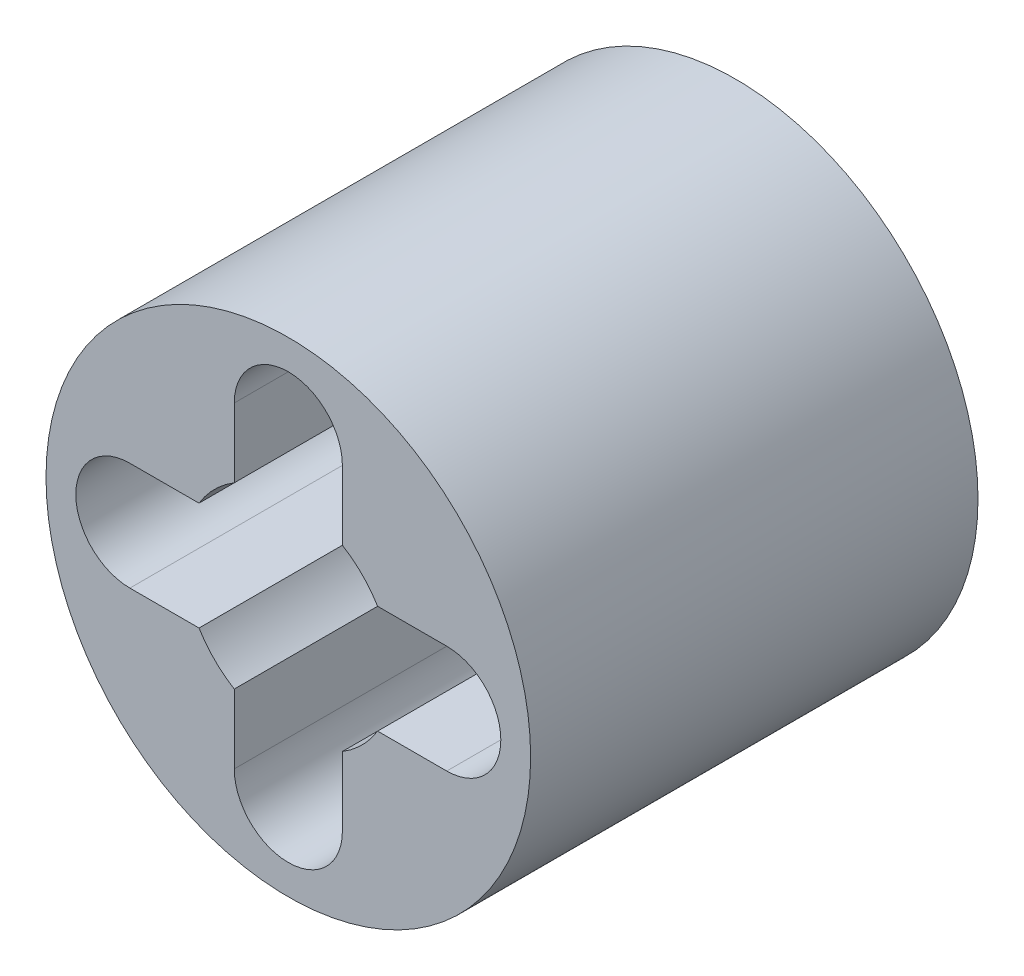
ISO-10303-21;
HEADER;
FILE_DESCRIPTION(('STEP AP214'),'2;1');
FILE_NAME('part.step','',(''),(''),'','','');
FILE_SCHEMA(('AUTOMOTIVE_DESIGN { 1 0 10303 214 1 1 1 1 }'));
ENDSEC;
DATA;
#1=APPLICATION_CONTEXT('core data for automotive mechanical design processes');
#2=APPLICATION_PROTOCOL_DEFINITION('international standard','automotive_design',2000,#1);
#3=PRODUCT_CONTEXT('',#1,'mechanical');
#4=PRODUCT('Part','Part','',(#3));
#5=PRODUCT_RELATED_PRODUCT_CATEGORY('part','',(#4));
#6=PRODUCT_DEFINITION_FORMATION('','',#4);
#7=PRODUCT_DEFINITION_CONTEXT('part definition',#1,'design');
#8=PRODUCT_DEFINITION('design','',#6,#7);
#9=PRODUCT_DEFINITION_SHAPE('','',#8);
#10=(LENGTH_UNIT() NAMED_UNIT(*) SI_UNIT(.MILLI.,.METRE.));
#11=(NAMED_UNIT(*) PLANE_ANGLE_UNIT() SI_UNIT($,.RADIAN.));
#12=(NAMED_UNIT(*) SI_UNIT($,.STERADIAN.) SOLID_ANGLE_UNIT());
#13=UNCERTAINTY_MEASURE_WITH_UNIT(LENGTH_MEASURE(1.E-05),#10,'distance_accuracy_value','');
#14=(GEOMETRIC_REPRESENTATION_CONTEXT(3) GLOBAL_UNCERTAINTY_ASSIGNED_CONTEXT((#13)) GLOBAL_UNIT_ASSIGNED_CONTEXT((#10,
#11,#12)) REPRESENTATION_CONTEXT('',''));
#15=CARTESIAN_POINT('',(0.,0.,0.));
#16=DIRECTION('',(0.,0.,1.));
#17=DIRECTION('',(1.,0.,0.));
#18=AXIS2_PLACEMENT_3D('',#15,#16,#17);
#19=CARTESIAN_POINT('',(0.,0.,6.));
#20=DIRECTION('',(0.,0.,1.));
#21=DIRECTION('',(1.,0.,0.));
#22=AXIS2_PLACEMENT_3D('',#19,#20,#21);
#23=PLANE('',#22);
#24=CARTESIAN_POINT('',(0.,0.,6.));
#25=DIRECTION('',(0.,0.,1.));
#26=DIRECTION('',(1.,0.,0.));
#27=AXIS2_PLACEMENT_3D('',#24,#25,#26);
#28=CIRCLE('',#27,3.25);
#29=CARTESIAN_POINT('',(3.25,0.,6.));
#30=VERTEX_POINT('',#29);
#31=EDGE_CURVE('E11',#30,#30,#28,.T.);
#32=ORIENTED_EDGE('',*,*,#31,.T.);
#33=EDGE_LOOP('',(#32));
#34=FACE_BOUND('',#33,.T.);
#35=DIRECTION('',(1.,0.,0.));
#36=VECTOR('',#35,1.);
#37=CARTESIAN_POINT('',(2.12500000000006,-0.724999999999936,6.));
#38=LINE('',#37,#36);
#39=CARTESIAN_POINT('',(1.19765395670039,-0.724999999999937,6.));
#40=VERTEX_POINT('',#39);
#41=CARTESIAN_POINT('',(2.12500000000006,-0.724999999999936,6.));
#42=VERTEX_POINT('',#41);
#43=EDGE_CURVE('E154',#40,#42,#38,.T.);
#44=ORIENTED_EDGE('',*,*,#43,.F.);
#45=CARTESIAN_POINT('',(0.,0.,6.));
#46=DIRECTION('',(0.,0.,1.));
#47=DIRECTION('',(1.,0.,0.));
#48=AXIS2_PLACEMENT_3D('',#45,#46,#47);
#49=CIRCLE('',#48,1.4);
#50=CARTESIAN_POINT('',(0.725000000000126,-1.19765395670027,6.));
#51=VERTEX_POINT('',#50);
#52=EDGE_CURVE('E146',#51,#40,#49,.T.);
#53=ORIENTED_EDGE('',*,*,#52,.F.);
#54=DIRECTION('',(0.,1.,0.));
#55=VECTOR('',#54,1.);
#56=CARTESIAN_POINT('',(0.725000000000126,-2.125,6.));
#57=LINE('',#56,#55);
#58=CARTESIAN_POINT('',(0.725000000000126,-2.125,6.));
#59=VERTEX_POINT('',#58);
#60=EDGE_CURVE('E194',#59,#51,#57,.T.);
#61=ORIENTED_EDGE('',*,*,#60,.F.);
#62=CARTESIAN_POINT('',(1.25919392671686E-13,-2.125,6.));
#63=DIRECTION('',(0.,0.,1.));
#64=DIRECTION('',(1.,0.,0.));
#65=AXIS2_PLACEMENT_3D('',#62,#63,#64);
#66=CIRCLE('',#65,0.725);
#67=CARTESIAN_POINT('',(-0.724999999999874,-2.125,6.));
#68=VERTEX_POINT('',#67);
#69=EDGE_CURVE('E192',#68,#59,#66,.T.);
#70=ORIENTED_EDGE('',*,*,#69,.F.);
#71=DIRECTION('',(0.,-1.,0.));
#72=VECTOR('',#71,1.);
#73=CARTESIAN_POINT('',(-0.724999999999874,-2.125,6.));
#74=LINE('',#73,#72);
#75=CARTESIAN_POINT('',(-0.724999999999874,-1.19765395670042,6.));
#76=VERTEX_POINT('',#75);
#77=EDGE_CURVE('E190',#76,#68,#74,.T.);
#78=ORIENTED_EDGE('',*,*,#77,.F.);
#79=CARTESIAN_POINT('',(0.,0.,6.));
#80=DIRECTION('',(0.,0.,1.));
#81=DIRECTION('',(1.,0.,0.));
#82=AXIS2_PLACEMENT_3D('',#79,#80,#81);
#83=CIRCLE('',#82,1.4);
#84=CARTESIAN_POINT('',(-1.19765395670031,-0.725000000000063,6.));
#85=VERTEX_POINT('',#84);
#86=EDGE_CURVE('E188',#85,#76,#83,.T.);
#87=ORIENTED_EDGE('',*,*,#86,.F.);
#88=DIRECTION('',(1.,0.,0.));
#89=VECTOR('',#88,1.);
#90=CARTESIAN_POINT('',(-2.12499999999994,-0.725000000000063,6.));
#91=LINE('',#90,#89);
#92=CARTESIAN_POINT('',(-2.12499999999994,-0.725000000000063,6.));
#93=VERTEX_POINT('',#92);
#94=EDGE_CURVE('E186',#93,#85,#91,.T.);
#95=ORIENTED_EDGE('',*,*,#94,.F.);
#96=CARTESIAN_POINT('',(-2.12499999999994,0.,6.));
#97=DIRECTION('',(0.,0.,1.));
#98=DIRECTION('',(1.,0.,0.));
#99=AXIS2_PLACEMENT_3D('',#96,#97,#98);
#100=CIRCLE('',#99,0.725);
#101=CARTESIAN_POINT('',(-2.12499999999994,0.724999999999937,6.));
#102=VERTEX_POINT('',#101);
#103=EDGE_CURVE('E184',#102,#93,#100,.T.);
#104=ORIENTED_EDGE('',*,*,#103,.F.);
#105=DIRECTION('',(-1.,0.,0.));
#106=VECTOR('',#105,1.);
#107=CARTESIAN_POINT('',(-2.12499999999994,0.724999999999937,6.));
#108=LINE('',#107,#106);
#109=CARTESIAN_POINT('',(-1.19765395670039,0.724999999999937,6.));
#110=VERTEX_POINT('',#109);
#111=EDGE_CURVE('E182',#110,#102,#108,.T.);
#112=ORIENTED_EDGE('',*,*,#111,.F.);
#113=CARTESIAN_POINT('',(0.,0.,6.));
#114=DIRECTION('',(0.,0.,1.));
#115=DIRECTION('',(1.,0.,0.));
#116=AXIS2_PLACEMENT_3D('',#113,#114,#115);
#117=CIRCLE('',#116,1.4);
#118=CARTESIAN_POINT('',(-0.725,1.19765395670035,6.));
#119=VERTEX_POINT('',#118);
#120=EDGE_CURVE('E180',#119,#110,#117,.T.);
#121=ORIENTED_EDGE('',*,*,#120,.F.);
#122=DIRECTION('',(0.,-1.,0.));
#123=VECTOR('',#122,1.);
#124=CARTESIAN_POINT('',(-0.725,2.125,6.));
#125=LINE('',#124,#123);
#126=CARTESIAN_POINT('',(-0.725,2.125,6.));
#127=VERTEX_POINT('',#126);
#128=EDGE_CURVE('E178',#127,#119,#125,.T.);
#129=ORIENTED_EDGE('',*,*,#128,.F.);
#130=CARTESIAN_POINT('',(0.,2.125,6.));
#131=DIRECTION('',(0.,0.,1.));
#132=DIRECTION('',(1.,0.,0.));
#133=AXIS2_PLACEMENT_3D('',#130,#131,#132);
#134=CIRCLE('',#133,0.725);
#135=CARTESIAN_POINT('',(0.725,2.125,6.));
#136=VERTEX_POINT('',#135);
#137=EDGE_CURVE('E176',#136,#127,#134,.T.);
#138=ORIENTED_EDGE('',*,*,#137,.F.);
#139=DIRECTION('',(0.,1.,0.));
#140=VECTOR('',#139,1.);
#141=CARTESIAN_POINT('',(0.725,2.125,6.));
#142=LINE('',#141,#140);
#143=CARTESIAN_POINT('',(0.725,1.19765395670035,6.));
#144=VERTEX_POINT('',#143);
#145=EDGE_CURVE('E174',#144,#136,#142,.T.);
#146=ORIENTED_EDGE('',*,*,#145,.F.);
#147=CARTESIAN_POINT('',(0.,0.,6.));
#148=DIRECTION('',(0.,0.,1.));
#149=DIRECTION('',(1.,0.,0.));
#150=AXIS2_PLACEMENT_3D('',#147,#148,#149);
#151=CIRCLE('',#150,1.4);
#152=CARTESIAN_POINT('',(1.19765395670031,0.725000000000063,6.));
#153=VERTEX_POINT('',#152);
#154=EDGE_CURVE('E172',#153,#144,#151,.T.);
#155=ORIENTED_EDGE('',*,*,#154,.F.);
#156=DIRECTION('',(-1.,0.,0.));
#157=VECTOR('',#156,1.);
#158=CARTESIAN_POINT('',(2.12500000000006,0.725000000000064,6.));
#159=LINE('',#158,#157);
#160=CARTESIAN_POINT('',(2.12500000000006,0.725000000000064,6.));
#161=VERTEX_POINT('',#160);
#162=EDGE_CURVE('E168',#161,#153,#159,.T.);
#163=ORIENTED_EDGE('',*,*,#162,.F.);
#164=CARTESIAN_POINT('',(2.12500000000006,0.,6.));
#165=DIRECTION('',(0.,0.,1.));
#166=DIRECTION('',(1.,0.,0.));
#167=AXIS2_PLACEMENT_3D('',#164,#165,#166);
#168=CIRCLE('',#167,0.725);
#169=EDGE_CURVE('E166',#42,#161,#168,.T.);
#170=ORIENTED_EDGE('',*,*,#169,.F.);
#171=EDGE_LOOP('',(#44,#53,#61,#70,#78,#87,#95,#104,#112,#121,#129,#138,#146,#155,#163,#170));
#172=FACE_BOUND('',#171,.T.);
#173=ADVANCED_FACE('F33',(#34,#172),#23,.T.);
#174=CARTESIAN_POINT('',(0.,0.,0.));
#175=DIRECTION('',(0.,0.,1.));
#176=DIRECTION('',(1.,0.,0.));
#177=AXIS2_PLACEMENT_3D('',#174,#175,#176);
#178=PLANE('',#177);
#179=CARTESIAN_POINT('',(0.,0.,0.));
#180=DIRECTION('',(0.,0.,1.));
#181=DIRECTION('',(1.,0.,0.));
#182=AXIS2_PLACEMENT_3D('',#179,#180,#181);
#183=CIRCLE('',#182,3.25);
#184=CARTESIAN_POINT('',(3.25,0.,0.));
#185=VERTEX_POINT('',#184);
#186=EDGE_CURVE('E37',#185,#185,#183,.T.);
#187=ORIENTED_EDGE('',*,*,#186,.F.);
#188=EDGE_LOOP('',(#187));
#189=FACE_BOUND('',#188,.T.);
#190=CARTESIAN_POINT('',(0.,0.,0.));
#191=DIRECTION('',(0.,0.,1.));
#192=DIRECTION('',(1.,0.,0.));
#193=AXIS2_PLACEMENT_3D('',#190,#191,#192);
#194=CIRCLE('',#193,1.4);
#195=CARTESIAN_POINT('',(0.725000000000126,-1.19765395670027,0.));
#196=VERTEX_POINT('',#195);
#197=CARTESIAN_POINT('',(1.19765395670039,-0.724999999999937,0.));
#198=VERTEX_POINT('',#197);
#199=EDGE_CURVE('E56',#196,#198,#194,.T.);
#200=ORIENTED_EDGE('',*,*,#199,.T.);
#201=DIRECTION('',(1.,0.,0.));
#202=VECTOR('',#201,1.);
#203=CARTESIAN_POINT('',(2.12500000000006,-0.724999999999936,0.));
#204=LINE('',#203,#202);
#205=CARTESIAN_POINT('',(2.12500000000006,-0.724999999999936,0.));
#206=VERTEX_POINT('',#205);
#207=EDGE_CURVE('E161',#198,#206,#204,.T.);
#208=ORIENTED_EDGE('',*,*,#207,.T.);
#209=CARTESIAN_POINT('',(2.12500000000006,0.,0.));
#210=DIRECTION('',(0.,0.,1.));
#211=DIRECTION('',(1.,0.,0.));
#212=AXIS2_PLACEMENT_3D('',#209,#210,#211);
#213=CIRCLE('',#212,0.725);
#214=CARTESIAN_POINT('',(2.12500000000006,0.725000000000064,0.));
#215=VERTEX_POINT('',#214);
#216=EDGE_CURVE('E198',#206,#215,#213,.T.);
#217=ORIENTED_EDGE('',*,*,#216,.T.);
#218=DIRECTION('',(-1.,0.,0.));
#219=VECTOR('',#218,1.);
#220=CARTESIAN_POINT('',(2.12500000000006,0.725000000000064,0.));
#221=LINE('',#220,#219);
#222=CARTESIAN_POINT('',(1.19765395670031,0.725000000000063,0.));
#223=VERTEX_POINT('',#222);
#224=EDGE_CURVE('E201',#215,#223,#221,.T.);
#225=ORIENTED_EDGE('',*,*,#224,.T.);
#226=CARTESIAN_POINT('',(0.,0.,0.));
#227=DIRECTION('',(0.,0.,1.));
#228=DIRECTION('',(1.,0.,0.));
#229=AXIS2_PLACEMENT_3D('',#226,#227,#228);
#230=CIRCLE('',#229,1.4);
#231=CARTESIAN_POINT('',(0.725,1.19765395670035,0.));
#232=VERTEX_POINT('',#231);
#233=EDGE_CURVE('E204',#223,#232,#230,.T.);
#234=ORIENTED_EDGE('',*,*,#233,.T.);
#235=DIRECTION('',(0.,1.,0.));
#236=VECTOR('',#235,1.);
#237=CARTESIAN_POINT('',(0.725,2.125,0.));
#238=LINE('',#237,#236);
#239=CARTESIAN_POINT('',(0.725,2.125,0.));
#240=VERTEX_POINT('',#239);
#241=EDGE_CURVE('E207',#232,#240,#238,.T.);
#242=ORIENTED_EDGE('',*,*,#241,.T.);
#243=CARTESIAN_POINT('',(0.,2.125,0.));
#244=DIRECTION('',(0.,0.,1.));
#245=DIRECTION('',(1.,0.,0.));
#246=AXIS2_PLACEMENT_3D('',#243,#244,#245);
#247=CIRCLE('',#246,0.725);
#248=CARTESIAN_POINT('',(-0.725,2.125,0.));
#249=VERTEX_POINT('',#248);
#250=EDGE_CURVE('E210',#240,#249,#247,.T.);
#251=ORIENTED_EDGE('',*,*,#250,.T.);
#252=DIRECTION('',(0.,-1.,0.));
#253=VECTOR('',#252,1.);
#254=CARTESIAN_POINT('',(-0.725,2.125,0.));
#255=LINE('',#254,#253);
#256=CARTESIAN_POINT('',(-0.725,1.19765395670035,0.));
#257=VERTEX_POINT('',#256);
#258=EDGE_CURVE('E213',#249,#257,#255,.T.);
#259=ORIENTED_EDGE('',*,*,#258,.T.);
#260=CARTESIAN_POINT('',(0.,0.,0.));
#261=DIRECTION('',(0.,0.,1.));
#262=DIRECTION('',(1.,0.,0.));
#263=AXIS2_PLACEMENT_3D('',#260,#261,#262);
#264=CIRCLE('',#263,1.4);
#265=CARTESIAN_POINT('',(-1.19765395670039,0.724999999999937,0.));
#266=VERTEX_POINT('',#265);
#267=EDGE_CURVE('E216',#257,#266,#264,.T.);
#268=ORIENTED_EDGE('',*,*,#267,.T.);
#269=DIRECTION('',(-1.,0.,0.));
#270=VECTOR('',#269,1.);
#271=CARTESIAN_POINT('',(-2.12499999999994,0.724999999999937,0.));
#272=LINE('',#271,#270);
#273=CARTESIAN_POINT('',(-2.12499999999994,0.724999999999937,0.));
#274=VERTEX_POINT('',#273);
#275=EDGE_CURVE('E219',#266,#274,#272,.T.);
#276=ORIENTED_EDGE('',*,*,#275,.T.);
#277=CARTESIAN_POINT('',(-2.12499999999994,0.,0.));
#278=DIRECTION('',(0.,0.,1.));
#279=DIRECTION('',(1.,0.,0.));
#280=AXIS2_PLACEMENT_3D('',#277,#278,#279);
#281=CIRCLE('',#280,0.725);
#282=CARTESIAN_POINT('',(-2.12499999999994,-0.725000000000063,0.));
#283=VERTEX_POINT('',#282);
#284=EDGE_CURVE('E222',#274,#283,#281,.T.);
#285=ORIENTED_EDGE('',*,*,#284,.T.);
#286=DIRECTION('',(1.,0.,0.));
#287=VECTOR('',#286,1.);
#288=CARTESIAN_POINT('',(-2.12499999999994,-0.725000000000063,0.));
#289=LINE('',#288,#287);
#290=CARTESIAN_POINT('',(-1.19765395670031,-0.725000000000063,0.));
#291=VERTEX_POINT('',#290);
#292=EDGE_CURVE('E225',#283,#291,#289,.T.);
#293=ORIENTED_EDGE('',*,*,#292,.T.);
#294=CARTESIAN_POINT('',(0.,0.,0.));
#295=DIRECTION('',(0.,0.,1.));
#296=DIRECTION('',(1.,0.,0.));
#297=AXIS2_PLACEMENT_3D('',#294,#295,#296);
#298=CIRCLE('',#297,1.4);
#299=CARTESIAN_POINT('',(-0.724999999999874,-1.19765395670042,0.));
#300=VERTEX_POINT('',#299);
#301=EDGE_CURVE('E228',#291,#300,#298,.T.);
#302=ORIENTED_EDGE('',*,*,#301,.T.);
#303=DIRECTION('',(0.,-1.,0.));
#304=VECTOR('',#303,1.);
#305=CARTESIAN_POINT('',(-0.724999999999874,-2.125,0.));
#306=LINE('',#305,#304);
#307=CARTESIAN_POINT('',(-0.724999999999874,-2.125,0.));
#308=VERTEX_POINT('',#307);
#309=EDGE_CURVE('E231',#300,#308,#306,.T.);
#310=ORIENTED_EDGE('',*,*,#309,.T.);
#311=CARTESIAN_POINT('',(1.25919392671686E-13,-2.125,0.));
#312=DIRECTION('',(0.,0.,1.));
#313=DIRECTION('',(1.,0.,0.));
#314=AXIS2_PLACEMENT_3D('',#311,#312,#313);
#315=CIRCLE('',#314,0.725);
#316=CARTESIAN_POINT('',(0.725000000000126,-2.125,0.));
#317=VERTEX_POINT('',#316);
#318=EDGE_CURVE('E234',#308,#317,#315,.T.);
#319=ORIENTED_EDGE('',*,*,#318,.T.);
#320=DIRECTION('',(0.,1.,0.));
#321=VECTOR('',#320,1.);
#322=CARTESIAN_POINT('',(0.725000000000126,-2.125,0.));
#323=LINE('',#322,#321);
#324=EDGE_CURVE('E155',#317,#196,#323,.T.);
#325=ORIENTED_EDGE('',*,*,#324,.T.);
#326=EDGE_LOOP('',(#200,#208,#217,#225,#234,#242,#251,#259,#268,#276,#285,#293,#302,#310,#319,#325));
#327=FACE_BOUND('',#326,.T.);
#328=ADVANCED_FACE('F271',(#189,#327),#178,.F.);
#329=CARTESIAN_POINT('',(0.,0.,6.));
#330=DIRECTION('',(0.,0.,-1.));
#331=DIRECTION('',(-1.,0.,0.));
#332=AXIS2_PLACEMENT_3D('',#329,#330,#331);
#333=CYLINDRICAL_SURFACE('',#332,3.25);
#334=ORIENTED_EDGE('',*,*,#31,.F.);
#335=EDGE_LOOP('',(#334));
#336=FACE_BOUND('',#335,.T.);
#337=ORIENTED_EDGE('',*,*,#186,.T.);
#338=EDGE_LOOP('',(#337));
#339=FACE_BOUND('',#338,.T.);
#340=ADVANCED_FACE('F35',(#336,#339),#333,.T.);
#341=CARTESIAN_POINT('',(0.,0.,6.));
#342=DIRECTION('',(0.,0.,-1.));
#343=DIRECTION('',(-1.,0.,0.));
#344=AXIS2_PLACEMENT_3D('',#341,#342,#343);
#345=CYLINDRICAL_SURFACE('',#344,1.4);
#346=ORIENTED_EDGE('',*,*,#199,.F.);
#347=DIRECTION('',(0.,0.,-1.));
#348=VECTOR('',#347,1.);
#349=CARTESIAN_POINT('',(0.725000000000126,-1.19765395670027,6.));
#350=LINE('',#349,#348);
#351=EDGE_CURVE('E150',#51,#196,#350,.T.);
#352=ORIENTED_EDGE('',*,*,#351,.F.);
#353=ORIENTED_EDGE('',*,*,#52,.T.);
#354=DIRECTION('',(0.,0.,-1.));
#355=VECTOR('',#354,1.);
#356=CARTESIAN_POINT('',(1.19765395670039,-0.724999999999937,6.));
#357=LINE('',#356,#355);
#358=EDGE_CURVE('E149',#40,#198,#357,.T.);
#359=ORIENTED_EDGE('',*,*,#358,.T.);
#360=EDGE_LOOP('',(#346,#352,#353,#359));
#361=FACE_BOUND('',#360,.T.);
#362=ADVANCED_FACE('F148',(#361),#345,.F.);
#363=CARTESIAN_POINT('',(2.12500000000006,-0.724999999999936,6.));
#364=DIRECTION('',(0.,1.,0.));
#365=DIRECTION('',(-1.,0.,0.));
#366=AXIS2_PLACEMENT_3D('',#363,#364,#365);
#367=PLANE('',#366);
#368=ORIENTED_EDGE('',*,*,#207,.F.);
#369=ORIENTED_EDGE('',*,*,#358,.F.);
#370=ORIENTED_EDGE('',*,*,#43,.T.);
#371=DIRECTION('',(0.,0.,-1.));
#372=VECTOR('',#371,1.);
#373=CARTESIAN_POINT('',(2.12500000000006,-0.724999999999936,6.));
#374=LINE('',#373,#372);
#375=EDGE_CURVE('E162',#42,#206,#374,.T.);
#376=ORIENTED_EDGE('',*,*,#375,.T.);
#377=EDGE_LOOP('',(#368,#369,#370,#376));
#378=FACE_BOUND('',#377,.T.);
#379=ADVANCED_FACE('F158',(#378),#367,.T.);
#380=CARTESIAN_POINT('',(2.12500000000006,0.,6.));
#381=DIRECTION('',(0.,0.,-1.));
#382=DIRECTION('',(-1.,0.,0.));
#383=AXIS2_PLACEMENT_3D('',#380,#381,#382);
#384=CYLINDRICAL_SURFACE('',#383,0.725);
#385=ORIENTED_EDGE('',*,*,#216,.F.);
#386=ORIENTED_EDGE('',*,*,#375,.F.);
#387=ORIENTED_EDGE('',*,*,#169,.T.);
#388=DIRECTION('',(0.,0.,-1.));
#389=VECTOR('',#388,1.);
#390=CARTESIAN_POINT('',(2.12500000000006,0.725000000000064,6.));
#391=LINE('',#390,#389);
#392=EDGE_CURVE('E263',#161,#215,#391,.T.);
#393=ORIENTED_EDGE('',*,*,#392,.T.);
#394=EDGE_LOOP('',(#385,#386,#387,#393));
#395=FACE_BOUND('',#394,.T.);
#396=ADVANCED_FACE('F267',(#395),#384,.F.);
#397=CARTESIAN_POINT('',(2.12500000000006,0.725000000000064,6.));
#398=DIRECTION('',(0.,-1.,0.));
#399=DIRECTION('',(1.,0.,0.));
#400=AXIS2_PLACEMENT_3D('',#397,#398,#399);
#401=PLANE('',#400);
#402=ORIENTED_EDGE('',*,*,#224,.F.);
#403=ORIENTED_EDGE('',*,*,#392,.F.);
#404=ORIENTED_EDGE('',*,*,#162,.T.);
#405=DIRECTION('',(0.,0.,-1.));
#406=VECTOR('',#405,1.);
#407=CARTESIAN_POINT('',(1.19765395670031,0.725000000000063,6.));
#408=LINE('',#407,#406);
#409=EDGE_CURVE('E261',#153,#223,#408,.T.);
#410=ORIENTED_EDGE('',*,*,#409,.T.);
#411=EDGE_LOOP('',(#402,#403,#404,#410));
#412=FACE_BOUND('',#411,.T.);
#413=ADVANCED_FACE('F329',(#412),#401,.T.);
#414=CARTESIAN_POINT('',(0.,0.,6.));
#415=DIRECTION('',(0.,0.,-1.));
#416=DIRECTION('',(-1.,0.,0.));
#417=AXIS2_PLACEMENT_3D('',#414,#415,#416);
#418=CYLINDRICAL_SURFACE('',#417,1.4);
#419=ORIENTED_EDGE('',*,*,#233,.F.);
#420=ORIENTED_EDGE('',*,*,#409,.F.);
#421=ORIENTED_EDGE('',*,*,#154,.T.);
#422=DIRECTION('',(0.,0.,-1.));
#423=VECTOR('',#422,1.);
#424=CARTESIAN_POINT('',(0.725,1.19765395670035,6.));
#425=LINE('',#424,#423);
#426=EDGE_CURVE('E259',#144,#232,#425,.T.);
#427=ORIENTED_EDGE('',*,*,#426,.T.);
#428=EDGE_LOOP('',(#419,#420,#421,#427));
#429=FACE_BOUND('',#428,.T.);
#430=ADVANCED_FACE('F326',(#429),#418,.F.);
#431=CARTESIAN_POINT('',(0.725,2.125,6.));
#432=DIRECTION('',(-1.,0.,0.));
#433=DIRECTION('',(0.,-1.,0.));
#434=AXIS2_PLACEMENT_3D('',#431,#432,#433);
#435=PLANE('',#434);
#436=ORIENTED_EDGE('',*,*,#241,.F.);
#437=ORIENTED_EDGE('',*,*,#426,.F.);
#438=ORIENTED_EDGE('',*,*,#145,.T.);
#439=DIRECTION('',(0.,0.,-1.));
#440=VECTOR('',#439,1.);
#441=CARTESIAN_POINT('',(0.725,2.125,6.));
#442=LINE('',#441,#440);
#443=EDGE_CURVE('E257',#136,#240,#442,.T.);
#444=ORIENTED_EDGE('',*,*,#443,.T.);
#445=EDGE_LOOP('',(#436,#437,#438,#444));
#446=FACE_BOUND('',#445,.T.);
#447=ADVANCED_FACE('F323',(#446),#435,.T.);
#448=CARTESIAN_POINT('',(0.,2.125,6.));
#449=DIRECTION('',(0.,0.,-1.));
#450=DIRECTION('',(-1.,0.,0.));
#451=AXIS2_PLACEMENT_3D('',#448,#449,#450);
#452=CYLINDRICAL_SURFACE('',#451,0.725);
#453=ORIENTED_EDGE('',*,*,#250,.F.);
#454=ORIENTED_EDGE('',*,*,#443,.F.);
#455=ORIENTED_EDGE('',*,*,#137,.T.);
#456=DIRECTION('',(0.,0.,-1.));
#457=VECTOR('',#456,1.);
#458=CARTESIAN_POINT('',(-0.725,2.125,6.));
#459=LINE('',#458,#457);
#460=EDGE_CURVE('E255',#127,#249,#459,.T.);
#461=ORIENTED_EDGE('',*,*,#460,.T.);
#462=EDGE_LOOP('',(#453,#454,#455,#461));
#463=FACE_BOUND('',#462,.T.);
#464=ADVANCED_FACE('F316',(#463),#452,.F.);
#465=CARTESIAN_POINT('',(-0.725,2.125,6.));
#466=DIRECTION('',(1.,0.,0.));
#467=DIRECTION('',(0.,1.,0.));
#468=AXIS2_PLACEMENT_3D('',#465,#466,#467);
#469=PLANE('',#468);
#470=ORIENTED_EDGE('',*,*,#258,.F.);
#471=ORIENTED_EDGE('',*,*,#460,.F.);
#472=ORIENTED_EDGE('',*,*,#128,.T.);
#473=DIRECTION('',(0.,0.,-1.));
#474=VECTOR('',#473,1.);
#475=CARTESIAN_POINT('',(-0.725,1.19765395670035,6.));
#476=LINE('',#475,#474);
#477=EDGE_CURVE('E253',#119,#257,#476,.T.);
#478=ORIENTED_EDGE('',*,*,#477,.T.);
#479=EDGE_LOOP('',(#470,#471,#472,#478));
#480=FACE_BOUND('',#479,.T.);
#481=ADVANCED_FACE('F312',(#480),#469,.T.);
#482=CARTESIAN_POINT('',(0.,0.,6.));
#483=DIRECTION('',(0.,0.,-1.));
#484=DIRECTION('',(-1.,0.,0.));
#485=AXIS2_PLACEMENT_3D('',#482,#483,#484);
#486=CYLINDRICAL_SURFACE('',#485,1.4);
#487=ORIENTED_EDGE('',*,*,#267,.F.);
#488=ORIENTED_EDGE('',*,*,#477,.F.);
#489=ORIENTED_EDGE('',*,*,#120,.T.);
#490=DIRECTION('',(0.,0.,-1.));
#491=VECTOR('',#490,1.);
#492=CARTESIAN_POINT('',(-1.19765395670039,0.724999999999937,6.));
#493=LINE('',#492,#491);
#494=EDGE_CURVE('E251',#110,#266,#493,.T.);
#495=ORIENTED_EDGE('',*,*,#494,.T.);
#496=EDGE_LOOP('',(#487,#488,#489,#495));
#497=FACE_BOUND('',#496,.T.);
#498=ADVANCED_FACE('F309',(#497),#486,.F.);
#499=CARTESIAN_POINT('',(-2.12499999999994,0.724999999999937,6.));
#500=DIRECTION('',(0.,-1.,0.));
#501=DIRECTION('',(0.,0.,-1.));
#502=AXIS2_PLACEMENT_3D('',#499,#500,#501);
#503=PLANE('',#502);
#504=ORIENTED_EDGE('',*,*,#275,.F.);
#505=ORIENTED_EDGE('',*,*,#494,.F.);
#506=ORIENTED_EDGE('',*,*,#111,.T.);
#507=DIRECTION('',(0.,0.,-1.));
#508=VECTOR('',#507,1.);
#509=CARTESIAN_POINT('',(-2.12499999999994,0.724999999999937,6.));
#510=LINE('',#509,#508);
#511=EDGE_CURVE('E249',#102,#274,#510,.T.);
#512=ORIENTED_EDGE('',*,*,#511,.T.);
#513=EDGE_LOOP('',(#504,#505,#506,#512));
#514=FACE_BOUND('',#513,.T.);
#515=ADVANCED_FACE('F301',(#514),#503,.T.);
#516=CARTESIAN_POINT('',(-2.12499999999994,0.,6.));
#517=DIRECTION('',(0.,0.,-1.));
#518=DIRECTION('',(-1.,0.,0.));
#519=AXIS2_PLACEMENT_3D('',#516,#517,#518);
#520=CYLINDRICAL_SURFACE('',#519,0.725);
#521=ORIENTED_EDGE('',*,*,#284,.F.);
#522=ORIENTED_EDGE('',*,*,#511,.F.);
#523=ORIENTED_EDGE('',*,*,#103,.T.);
#524=DIRECTION('',(0.,0.,-1.));
#525=VECTOR('',#524,1.);
#526=CARTESIAN_POINT('',(-2.12499999999994,-0.725000000000063,6.));
#527=LINE('',#526,#525);
#528=EDGE_CURVE('E247',#93,#283,#527,.T.);
#529=ORIENTED_EDGE('',*,*,#528,.T.);
#530=EDGE_LOOP('',(#521,#522,#523,#529));
#531=FACE_BOUND('',#530,.T.);
#532=ADVANCED_FACE('F297',(#531),#520,.F.);
#533=CARTESIAN_POINT('',(-2.12499999999994,-0.725000000000063,6.));
#534=DIRECTION('',(0.,1.,0.));
#535=DIRECTION('',(-1.,0.,0.));
#536=AXIS2_PLACEMENT_3D('',#533,#534,#535);
#537=PLANE('',#536);
#538=ORIENTED_EDGE('',*,*,#292,.F.);
#539=ORIENTED_EDGE('',*,*,#528,.F.);
#540=ORIENTED_EDGE('',*,*,#94,.T.);
#541=DIRECTION('',(0.,0.,-1.));
#542=VECTOR('',#541,1.);
#543=CARTESIAN_POINT('',(-1.19765395670031,-0.725000000000063,6.));
#544=LINE('',#543,#542);
#545=EDGE_CURVE('E245',#85,#291,#544,.T.);
#546=ORIENTED_EDGE('',*,*,#545,.T.);
#547=EDGE_LOOP('',(#538,#539,#540,#546));
#548=FACE_BOUND('',#547,.T.);
#549=ADVANCED_FACE('F294',(#548),#537,.T.);
#550=CARTESIAN_POINT('',(0.,0.,6.));
#551=DIRECTION('',(0.,0.,-1.));
#552=DIRECTION('',(-1.,0.,0.));
#553=AXIS2_PLACEMENT_3D('',#550,#551,#552);
#554=CYLINDRICAL_SURFACE('',#553,1.4);
#555=ORIENTED_EDGE('',*,*,#301,.F.);
#556=ORIENTED_EDGE('',*,*,#545,.F.);
#557=ORIENTED_EDGE('',*,*,#86,.T.);
#558=DIRECTION('',(0.,0.,-1.));
#559=VECTOR('',#558,1.);
#560=CARTESIAN_POINT('',(-0.724999999999874,-1.19765395670042,6.));
#561=LINE('',#560,#559);
#562=EDGE_CURVE('E243',#76,#300,#561,.T.);
#563=ORIENTED_EDGE('',*,*,#562,.T.);
#564=EDGE_LOOP('',(#555,#556,#557,#563));
#565=FACE_BOUND('',#564,.T.);
#566=ADVANCED_FACE('F286',(#565),#554,.F.);
#567=CARTESIAN_POINT('',(-0.724999999999874,-2.125,6.));
#568=DIRECTION('',(1.,0.,0.));
#569=DIRECTION('',(0.,1.,0.));
#570=AXIS2_PLACEMENT_3D('',#567,#568,#569);
#571=PLANE('',#570);
#572=ORIENTED_EDGE('',*,*,#309,.F.);
#573=ORIENTED_EDGE('',*,*,#562,.F.);
#574=ORIENTED_EDGE('',*,*,#77,.T.);
#575=DIRECTION('',(0.,0.,-1.));
#576=VECTOR('',#575,1.);
#577=CARTESIAN_POINT('',(-0.724999999999874,-2.125,6.));
#578=LINE('',#577,#576);
#579=EDGE_CURVE('E241',#68,#308,#578,.T.);
#580=ORIENTED_EDGE('',*,*,#579,.T.);
#581=EDGE_LOOP('',(#572,#573,#574,#580));
#582=FACE_BOUND('',#581,.T.);
#583=ADVANCED_FACE('F282',(#582),#571,.T.);
#584=CARTESIAN_POINT('',(1.25919392671686E-13,-2.125,6.));
#585=DIRECTION('',(0.,0.,-1.));
#586=DIRECTION('',(-1.,0.,0.));
#587=AXIS2_PLACEMENT_3D('',#584,#585,#586);
#588=CYLINDRICAL_SURFACE('',#587,0.725);
#589=ORIENTED_EDGE('',*,*,#318,.F.);
#590=ORIENTED_EDGE('',*,*,#579,.F.);
#591=ORIENTED_EDGE('',*,*,#69,.T.);
#592=DIRECTION('',(0.,0.,-1.));
#593=VECTOR('',#592,1.);
#594=CARTESIAN_POINT('',(0.725000000000126,-2.125,6.));
#595=LINE('',#594,#593);
#596=EDGE_CURVE('E48',#59,#317,#595,.T.);
#597=ORIENTED_EDGE('',*,*,#596,.T.);
#598=EDGE_LOOP('',(#589,#590,#591,#597));
#599=FACE_BOUND('',#598,.T.);
#600=ADVANCED_FACE('F279',(#599),#588,.F.);
#601=CARTESIAN_POINT('',(0.725000000000126,-2.125,6.));
#602=DIRECTION('',(-1.,0.,0.));
#603=DIRECTION('',(0.,0.,1.));
#604=AXIS2_PLACEMENT_3D('',#601,#602,#603);
#605=PLANE('',#604);
#606=ORIENTED_EDGE('',*,*,#324,.F.);
#607=ORIENTED_EDGE('',*,*,#596,.F.);
#608=ORIENTED_EDGE('',*,*,#60,.T.);
#609=ORIENTED_EDGE('',*,*,#351,.T.);
#610=EDGE_LOOP('',(#606,#607,#608,#609));
#611=FACE_BOUND('',#610,.T.);
#612=ADVANCED_FACE('F273',(#611),#605,.T.);
#613=CLOSED_SHELL('',(#173,#328,#340,#362,#379,#396,#413,#430,#447,#464,#481,#498,#515,#532,
#549,#566,#583,#600,#612));
#614=MANIFOLD_SOLID_BREP('B2',#613);
#615=ADVANCED_BREP_SHAPE_REPRESENTATION('',(#18,#614),#14);
#616=SHAPE_DEFINITION_REPRESENTATION(#9,#615);
ENDSEC;
END-ISO-10303-21;
